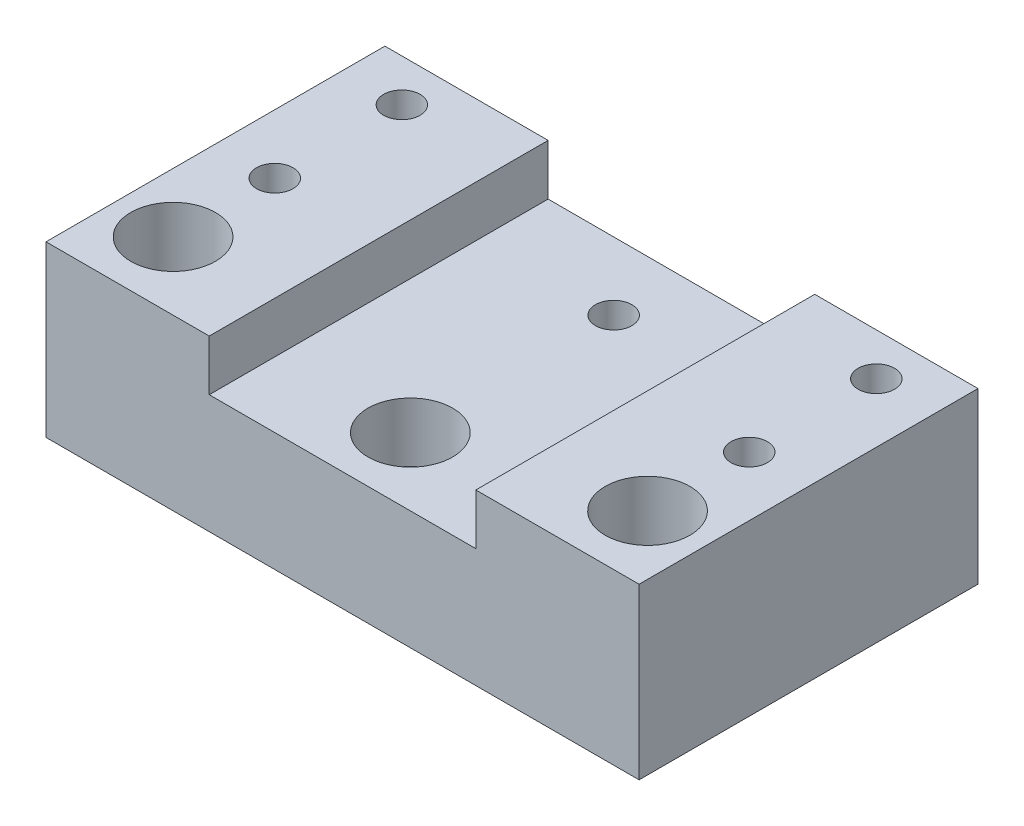
ISO-10303-21;
HEADER;
FILE_DESCRIPTION(('STEP AP214'),'2;1');
FILE_NAME('part.step','',(''),(''),'','','');
FILE_SCHEMA(('AUTOMOTIVE_DESIGN { 1 0 10303 214 1 1 1 1 }'));
ENDSEC;
DATA;
#1=APPLICATION_CONTEXT('core data for automotive mechanical design processes');
#2=APPLICATION_PROTOCOL_DEFINITION('international standard','automotive_design',2000,#1);
#3=PRODUCT_CONTEXT('',#1,'mechanical');
#4=PRODUCT('Part','Part','',(#3));
#5=PRODUCT_RELATED_PRODUCT_CATEGORY('part','',(#4));
#6=PRODUCT_DEFINITION_FORMATION('','',#4);
#7=PRODUCT_DEFINITION_CONTEXT('part definition',#1,'design');
#8=PRODUCT_DEFINITION('design','',#6,#7);
#9=PRODUCT_DEFINITION_SHAPE('','',#8);
#10=(LENGTH_UNIT() NAMED_UNIT(*) SI_UNIT(.MILLI.,.METRE.));
#11=(NAMED_UNIT(*) PLANE_ANGLE_UNIT() SI_UNIT($,.RADIAN.));
#12=(NAMED_UNIT(*) SI_UNIT($,.STERADIAN.) SOLID_ANGLE_UNIT());
#13=UNCERTAINTY_MEASURE_WITH_UNIT(LENGTH_MEASURE(1.E-05),#10,'distance_accuracy_value','');
#14=(GEOMETRIC_REPRESENTATION_CONTEXT(3) GLOBAL_UNCERTAINTY_ASSIGNED_CONTEXT((#13)) GLOBAL_UNIT_ASSIGNED_CONTEXT((#10,
#11,#12)) REPRESENTATION_CONTEXT('',''));
#15=CARTESIAN_POINT('',(0.,0.,0.));
#16=DIRECTION('',(0.,0.,1.));
#17=DIRECTION('',(1.,0.,0.));
#18=AXIS2_PLACEMENT_3D('',#15,#16,#17);
#19=CARTESIAN_POINT('',(-50.0721058637928,28.3687471029999,32.));
#20=DIRECTION('',(0.,1.,0.));
#21=DIRECTION('',(0.,0.,1.));
#22=AXIS2_PLACEMENT_3D('',#19,#20,#21);
#23=CYLINDRICAL_SURFACE('',#22,4.2);
#24=CARTESIAN_POINT('',(-50.0721058637928,14.3687471029999,32.));
#25=DIRECTION('',(0.,1.,0.));
#26=DIRECTION('',(0.,0.,1.));
#27=AXIS2_PLACEMENT_3D('',#24,#25,#26);
#28=CIRCLE('',#27,4.2);
#29=CARTESIAN_POINT('',(-50.0721058637928,14.3687471029999,36.2));
#30=VERTEX_POINT('',#29);
#31=EDGE_CURVE('E201',#30,#30,#28,.T.);
#32=ORIENTED_EDGE('',*,*,#31,.F.);
#33=EDGE_LOOP('',(#32));
#34=FACE_BOUND('',#33,.T.);
#35=CARTESIAN_POINT('',(-50.0721058637928,21.3687471029999,32.));
#36=DIRECTION('',(0.,1.,0.));
#37=DIRECTION('',(-1.,0.,0.));
#38=AXIS2_PLACEMENT_3D('',#35,#36,#37);
#39=CIRCLE('',#38,4.2);
#40=CARTESIAN_POINT('',(-54.2721058637928,21.3687471029999,32.));
#41=VERTEX_POINT('',#40);
#42=EDGE_CURVE('E50',#41,#41,#39,.F.);
#43=ORIENTED_EDGE('',*,*,#42,.F.);
#44=EDGE_LOOP('',(#43));
#45=FACE_BOUND('',#44,.T.);
#46=ADVANCED_FACE('F46',(#34,#45),#23,.F.);
#47=CARTESIAN_POINT('',(-22.0721058637928,34.3687471029999,32.));
#48=DIRECTION('',(0.,1.,0.));
#49=DIRECTION('',(0.,0.,1.));
#50=AXIS2_PLACEMENT_3D('',#47,#48,#49);
#51=CYLINDRICAL_SURFACE('',#50,2.65);
#52=CARTESIAN_POINT('',(-22.0721058637928,14.3687471029999,32.));
#53=DIRECTION('',(0.,1.,0.));
#54=DIRECTION('',(0.,0.,1.));
#55=AXIS2_PLACEMENT_3D('',#52,#53,#54);
#56=CIRCLE('',#55,2.65);
#57=CARTESIAN_POINT('',(-22.0721058637928,14.3687471029999,34.65));
#58=VERTEX_POINT('',#57);
#59=EDGE_CURVE('E212',#58,#58,#56,.T.);
#60=ORIENTED_EDGE('',*,*,#59,.F.);
#61=EDGE_LOOP('',(#60));
#62=FACE_BOUND('',#61,.T.);
#63=CARTESIAN_POINT('',(-22.0721058637928,22.3687471029999,32.));
#64=DIRECTION('',(0.,1.,0.));
#65=DIRECTION('',(0.,0.,1.));
#66=AXIS2_PLACEMENT_3D('',#63,#64,#65);
#67=CIRCLE('',#66,2.65);
#68=CARTESIAN_POINT('',(-22.0721058637928,22.3687471029999,34.65));
#69=VERTEX_POINT('',#68);
#70=EDGE_CURVE('E197',#69,#69,#67,.F.);
#71=ORIENTED_EDGE('',*,*,#70,.F.);
#72=EDGE_LOOP('',(#71));
#73=FACE_BOUND('',#72,.T.);
#74=ADVANCED_FACE('F290',(#62,#73),#51,.F.);
#75=CARTESIAN_POINT('',(-78.0721058637928,34.3687471029999,32.));
#76=DIRECTION('',(0.,1.,0.));
#77=DIRECTION('',(0.,0.,1.));
#78=AXIS2_PLACEMENT_3D('',#75,#76,#77);
#79=CYLINDRICAL_SURFACE('',#78,2.65);
#80=CARTESIAN_POINT('',(-78.0721058637928,14.3687471029999,32.));
#81=DIRECTION('',(0.,1.,0.));
#82=DIRECTION('',(0.,0.,1.));
#83=AXIS2_PLACEMENT_3D('',#80,#81,#82);
#84=CIRCLE('',#83,2.65);
#85=CARTESIAN_POINT('',(-78.0721058637928,14.3687471029999,34.65));
#86=VERTEX_POINT('',#85);
#87=EDGE_CURVE('E206',#86,#86,#84,.T.);
#88=ORIENTED_EDGE('',*,*,#87,.F.);
#89=EDGE_LOOP('',(#88));
#90=FACE_BOUND('',#89,.T.);
#91=CARTESIAN_POINT('',(-78.0721058637928,22.3687471029999,32.));
#92=DIRECTION('',(0.,1.,0.));
#93=DIRECTION('',(0.,0.,1.));
#94=AXIS2_PLACEMENT_3D('',#91,#92,#93);
#95=CIRCLE('',#94,2.65);
#96=CARTESIAN_POINT('',(-78.0721058637928,22.3687471029999,34.65));
#97=VERTEX_POINT('',#96);
#98=EDGE_CURVE('E194',#97,#97,#95,.F.);
#99=ORIENTED_EDGE('',*,*,#98,.F.);
#100=EDGE_LOOP('',(#99));
#101=FACE_BOUND('',#100,.T.);
#102=ADVANCED_FACE('F298',(#90,#101),#79,.F.);
#103=CARTESIAN_POINT('',(0.,34.3687471029999,40.));
#104=DIRECTION('',(0.,-1.,0.));
#105=DIRECTION('',(0.,0.,-1.));
#106=AXIS2_PLACEMENT_3D('',#103,#104,#105);
#107=PLANE('',#106);
#108=CARTESIAN_POINT('',(-22.0721058637928,34.3687471029999,32.));
#109=DIRECTION('',(0.,1.,0.));
#110=DIRECTION('',(0.,0.,1.));
#111=AXIS2_PLACEMENT_3D('',#108,#109,#110);
#112=CIRCLE('',#111,5.);
#113=CARTESIAN_POINT('',(-22.0721058637928,34.3687471029999,37.));
#114=VERTEX_POINT('',#113);
#115=EDGE_CURVE('E467',#114,#114,#112,.T.);
#116=ORIENTED_EDGE('',*,*,#115,.F.);
#117=EDGE_LOOP('',(#116));
#118=FACE_BOUND('',#117,.T.);
#119=CARTESIAN_POINT('',(-22.0721058637928,34.3687471029999,20.));
#120=DIRECTION('',(0.,1.,0.));
#121=DIRECTION('',(0.,0.,1.));
#122=AXIS2_PLACEMENT_3D('',#119,#120,#121);
#123=CIRCLE('',#122,2.15);
#124=CARTESIAN_POINT('',(-22.0721058637928,34.3687471029999,22.15));
#125=VERTEX_POINT('',#124);
#126=EDGE_CURVE('E237',#125,#125,#123,.T.);
#127=ORIENTED_EDGE('',*,*,#126,.F.);
#128=EDGE_LOOP('',(#127));
#129=FACE_BOUND('',#128,.T.);
#130=DIRECTION('',(-1.,0.,0.));
#131=VECTOR('',#130,1.);
#132=CARTESIAN_POINT('',(0.,34.3687471029999,0.));
#133=LINE('',#132,#131);
#134=CARTESIAN_POINT('',(-15.0721058637928,34.3687471029999,0.));
#135=VERTEX_POINT('',#134);
#136=CARTESIAN_POINT('',(-34.3387725304595,34.3687471029999,0.));
#137=VERTEX_POINT('',#136);
#138=EDGE_CURVE('E157',#135,#137,#133,.T.);
#139=ORIENTED_EDGE('',*,*,#138,.T.);
#140=DIRECTION('',(0.,0.,-1.));
#141=VECTOR('',#140,1.);
#142=CARTESIAN_POINT('',(-34.3387725304595,34.3687471029999,40.));
#143=LINE('',#142,#141);
#144=CARTESIAN_POINT('',(-34.3387725304595,34.3687471029999,40.));
#145=VERTEX_POINT('',#144);
#146=EDGE_CURVE('E187',#145,#137,#143,.T.);
#147=ORIENTED_EDGE('',*,*,#146,.F.);
#148=DIRECTION('',(-1.,0.,0.));
#149=VECTOR('',#148,1.);
#150=CARTESIAN_POINT('',(0.,34.3687471029999,40.));
#151=LINE('',#150,#149);
#152=CARTESIAN_POINT('',(-15.0721058637928,34.3687471029999,40.));
#153=VERTEX_POINT('',#152);
#154=EDGE_CURVE('E264',#153,#145,#151,.T.);
#155=ORIENTED_EDGE('',*,*,#154,.F.);
#156=DIRECTION('',(0.,0.,-1.));
#157=VECTOR('',#156,1.);
#158=CARTESIAN_POINT('',(-15.0721058637928,34.3687471029999,40.));
#159=LINE('',#158,#157);
#160=EDGE_CURVE('E57',#153,#135,#159,.T.);
#161=ORIENTED_EDGE('',*,*,#160,.T.);
#162=EDGE_LOOP('',(#139,#147,#155,#161));
#163=FACE_BOUND('',#162,.T.);
#164=CARTESIAN_POINT('',(-22.0721058637928,34.3687471029999,5.));
#165=DIRECTION('',(0.,1.,0.));
#166=DIRECTION('',(0.,0.,1.));
#167=AXIS2_PLACEMENT_3D('',#164,#165,#166);
#168=CIRCLE('',#167,2.15);
#169=CARTESIAN_POINT('',(-22.0721058637928,34.3687471029999,7.15));
#170=VERTEX_POINT('',#169);
#171=EDGE_CURVE('E245',#170,#170,#168,.T.);
#172=ORIENTED_EDGE('',*,*,#171,.F.);
#173=EDGE_LOOP('',(#172));
#174=FACE_BOUND('',#173,.T.);
#175=ADVANCED_FACE('F307',(#118,#129,#163,#174),#107,.F.);
#176=CARTESIAN_POINT('',(0.,14.3687471029999,40.));
#177=DIRECTION('',(0.,1.,0.));
#178=DIRECTION('',(-1.,0.,0.));
#179=AXIS2_PLACEMENT_3D('',#176,#177,#178);
#180=PLANE('',#179);
#181=ORIENTED_EDGE('',*,*,#31,.T.);
#182=EDGE_LOOP('',(#181));
#183=FACE_BOUND('',#182,.T.);
#184=ORIENTED_EDGE('',*,*,#87,.T.);
#185=EDGE_LOOP('',(#184));
#186=FACE_BOUND('',#185,.T.);
#187=ORIENTED_EDGE('',*,*,#59,.T.);
#188=EDGE_LOOP('',(#187));
#189=FACE_BOUND('',#188,.T.);
#190=CARTESIAN_POINT('',(-78.0721058637928,14.3687471029999,5.));
#191=DIRECTION('',(0.,1.,0.));
#192=DIRECTION('',(0.,0.,1.));
#193=AXIS2_PLACEMENT_3D('',#190,#191,#192);
#194=CIRCLE('',#193,2.15);
#195=CARTESIAN_POINT('',(-78.0721058637928,14.3687471029999,7.15));
#196=VERTEX_POINT('',#195);
#197=EDGE_CURVE('E225',#196,#196,#194,.T.);
#198=ORIENTED_EDGE('',*,*,#197,.T.);
#199=EDGE_LOOP('',(#198));
#200=FACE_BOUND('',#199,.T.);
#201=CARTESIAN_POINT('',(-78.0721058637928,14.3687471029999,20.));
#202=DIRECTION('',(0.,1.,0.));
#203=DIRECTION('',(0.,0.,1.));
#204=AXIS2_PLACEMENT_3D('',#201,#202,#203);
#205=CIRCLE('',#204,2.15);
#206=CARTESIAN_POINT('',(-78.0721058637928,14.3687471029999,22.15));
#207=VERTEX_POINT('',#206);
#208=EDGE_CURVE('E233',#207,#207,#205,.T.);
#209=ORIENTED_EDGE('',*,*,#208,.T.);
#210=EDGE_LOOP('',(#209));
#211=FACE_BOUND('',#210,.T.);
#212=CARTESIAN_POINT('',(-22.0721058637928,14.3687471029999,20.));
#213=DIRECTION('',(0.,1.,0.));
#214=DIRECTION('',(0.,0.,1.));
#215=AXIS2_PLACEMENT_3D('',#212,#213,#214);
#216=CIRCLE('',#215,2.15);
#217=CARTESIAN_POINT('',(-22.0721058637928,14.3687471029999,22.15));
#218=VERTEX_POINT('',#217);
#219=EDGE_CURVE('E241',#218,#218,#216,.T.);
#220=ORIENTED_EDGE('',*,*,#219,.T.);
#221=EDGE_LOOP('',(#220));
#222=FACE_BOUND('',#221,.T.);
#223=CARTESIAN_POINT('',(-22.0721058637928,14.3687471029999,5.));
#224=DIRECTION('',(0.,1.,0.));
#225=DIRECTION('',(0.,0.,1.));
#226=AXIS2_PLACEMENT_3D('',#223,#224,#225);
#227=CIRCLE('',#226,2.15);
#228=CARTESIAN_POINT('',(-22.0721058637928,14.3687471029999,7.14999999999999));
#229=VERTEX_POINT('',#228);
#230=EDGE_CURVE('E249',#229,#229,#227,.T.);
#231=ORIENTED_EDGE('',*,*,#230,.T.);
#232=EDGE_LOOP('',(#231));
#233=FACE_BOUND('',#232,.T.);
#234=CARTESIAN_POINT('',(-50.0721058637928,14.3687471029999,8.));
#235=DIRECTION('',(0.,1.,0.));
#236=DIRECTION('',(0.,0.,1.));
#237=AXIS2_PLACEMENT_3D('',#234,#235,#236);
#238=CIRCLE('',#237,2.15);
#239=CARTESIAN_POINT('',(-50.0721058637928,14.3687471029999,10.15));
#240=VERTEX_POINT('',#239);
#241=EDGE_CURVE('E154',#240,#240,#238,.T.);
#242=ORIENTED_EDGE('',*,*,#241,.T.);
#243=EDGE_LOOP('',(#242));
#244=FACE_BOUND('',#243,.T.);
#245=DIRECTION('',(1.,0.,0.));
#246=VECTOR('',#245,1.);
#247=CARTESIAN_POINT('',(0.,14.3687471029999,0.));
#248=LINE('',#247,#246);
#249=CARTESIAN_POINT('',(-85.0721058637928,14.3687471029999,0.));
#250=VERTEX_POINT('',#249);
#251=CARTESIAN_POINT('',(-15.0721058637928,14.3687471029999,0.));
#252=VERTEX_POINT('',#251);
#253=EDGE_CURVE('E150',#250,#252,#248,.T.);
#254=ORIENTED_EDGE('',*,*,#253,.T.);
#255=DIRECTION('',(0.,0.,-1.));
#256=VECTOR('',#255,1.);
#257=CARTESIAN_POINT('',(-15.0721058637928,14.3687471029999,40.));
#258=LINE('',#257,#256);
#259=CARTESIAN_POINT('',(-15.0721058637928,14.3687471029999,40.));
#260=VERTEX_POINT('',#259);
#261=EDGE_CURVE('E11',#260,#252,#258,.T.);
#262=ORIENTED_EDGE('',*,*,#261,.F.);
#263=DIRECTION('',(1.,0.,0.));
#264=VECTOR('',#263,1.);
#265=CARTESIAN_POINT('',(0.,14.3687471029999,40.));
#266=LINE('',#265,#264);
#267=CARTESIAN_POINT('',(-85.0721058637928,14.3687471029999,40.));
#268=VERTEX_POINT('',#267);
#269=EDGE_CURVE('E177',#268,#260,#266,.T.);
#270=ORIENTED_EDGE('',*,*,#269,.F.);
#271=DIRECTION('',(0.,0.,-1.));
#272=VECTOR('',#271,1.);
#273=CARTESIAN_POINT('',(-85.0721058637928,14.3687471029999,40.));
#274=LINE('',#273,#272);
#275=EDGE_CURVE('E66',#268,#250,#274,.T.);
#276=ORIENTED_EDGE('',*,*,#275,.T.);
#277=EDGE_LOOP('',(#254,#262,#270,#276));
#278=FACE_BOUND('',#277,.T.);
#279=ADVANCED_FACE('F48',(#183,#186,#189,#200,#211,#222,#233,#244,#278),#180,.F.);
#280=CARTESIAN_POINT('',(-15.0721058637928,0.,40.));
#281=DIRECTION('',(-1.,0.,0.));
#282=DIRECTION('',(0.,0.,1.));
#283=AXIS2_PLACEMENT_3D('',#280,#281,#282);
#284=PLANE('',#283);
#285=DIRECTION('',(0.,1.,0.));
#286=VECTOR('',#285,1.);
#287=CARTESIAN_POINT('',(-15.0721058637928,0.,0.));
#288=LINE('',#287,#286);
#289=EDGE_CURVE('E153',#252,#135,#288,.T.);
#290=ORIENTED_EDGE('',*,*,#289,.T.);
#291=ORIENTED_EDGE('',*,*,#160,.F.);
#292=DIRECTION('',(0.,1.,0.));
#293=VECTOR('',#292,1.);
#294=CARTESIAN_POINT('',(-15.0721058637928,0.,40.));
#295=LINE('',#294,#293);
#296=EDGE_CURVE('E104',#260,#153,#295,.T.);
#297=ORIENTED_EDGE('',*,*,#296,.F.);
#298=ORIENTED_EDGE('',*,*,#261,.T.);
#299=EDGE_LOOP('',(#290,#291,#297,#298));
#300=FACE_BOUND('',#299,.T.);
#301=ADVANCED_FACE('F368',(#300),#284,.F.);
#302=CARTESIAN_POINT('',(-34.3387725304595,0.,40.));
#303=DIRECTION('',(1.,0.,0.));
#304=DIRECTION('',(0.,0.,-1.));
#305=AXIS2_PLACEMENT_3D('',#302,#303,#304);
#306=PLANE('',#305);
#307=DIRECTION('',(0.,-1.,0.));
#308=VECTOR('',#307,1.);
#309=CARTESIAN_POINT('',(-34.3387725304595,0.,0.));
#310=LINE('',#309,#308);
#311=CARTESIAN_POINT('',(-34.3387725304595,28.3687471029999,0.));
#312=VERTEX_POINT('',#311);
#313=EDGE_CURVE('E160',#137,#312,#310,.T.);
#314=ORIENTED_EDGE('',*,*,#313,.T.);
#315=DIRECTION('',(0.,0.,-1.));
#316=VECTOR('',#315,1.);
#317=CARTESIAN_POINT('',(-34.3387725304595,28.3687471029999,40.));
#318=LINE('',#317,#316);
#319=CARTESIAN_POINT('',(-34.3387725304595,28.3687471029999,40.));
#320=VERTEX_POINT('',#319);
#321=EDGE_CURVE('E184',#320,#312,#318,.T.);
#322=ORIENTED_EDGE('',*,*,#321,.F.);
#323=DIRECTION('',(0.,-1.,0.));
#324=VECTOR('',#323,1.);
#325=CARTESIAN_POINT('',(-34.3387725304595,0.,40.));
#326=LINE('',#325,#324);
#327=EDGE_CURVE('E267',#145,#320,#326,.T.);
#328=ORIENTED_EDGE('',*,*,#327,.F.);
#329=ORIENTED_EDGE('',*,*,#146,.T.);
#330=EDGE_LOOP('',(#314,#322,#328,#329));
#331=FACE_BOUND('',#330,.T.);
#332=ADVANCED_FACE('F490',(#331),#306,.F.);
#333=CARTESIAN_POINT('',(0.,28.3687471029999,40.));
#334=DIRECTION('',(0.,1.,0.));
#335=DIRECTION('',(-1.,0.,0.));
#336=AXIS2_PLACEMENT_3D('',#333,#334,#335);
#337=PLANE('',#336);
#338=CARTESIAN_POINT('',(-50.0721058637928,28.3687471029999,32.));
#339=DIRECTION('',(0.,1.,0.));
#340=DIRECTION('',(-1.,0.,0.));
#341=AXIS2_PLACEMENT_3D('',#338,#339,#340);
#342=CIRCLE('',#341,5.);
#343=CARTESIAN_POINT('',(-55.0721058637928,28.3687471029999,32.));
#344=VERTEX_POINT('',#343);
#345=EDGE_CURVE('E454',#344,#344,#342,.T.);
#346=ORIENTED_EDGE('',*,*,#345,.F.);
#347=EDGE_LOOP('',(#346));
#348=FACE_BOUND('',#347,.T.);
#349=CARTESIAN_POINT('',(-50.0721058637928,28.3687471029999,8.));
#350=DIRECTION('',(0.,1.,0.));
#351=DIRECTION('',(0.,0.,1.));
#352=AXIS2_PLACEMENT_3D('',#349,#350,#351);
#353=CIRCLE('',#352,2.15);
#354=CARTESIAN_POINT('',(-50.0721058637928,28.3687471029999,10.15));
#355=VERTEX_POINT('',#354);
#356=EDGE_CURVE('E253',#355,#355,#353,.T.);
#357=ORIENTED_EDGE('',*,*,#356,.F.);
#358=EDGE_LOOP('',(#357));
#359=FACE_BOUND('',#358,.T.);
#360=DIRECTION('',(1.,0.,0.));
#361=VECTOR('',#360,1.);
#362=CARTESIAN_POINT('',(0.,28.3687471029999,0.));
#363=LINE('',#362,#361);
#364=CARTESIAN_POINT('',(-65.8054391971261,28.3687471029999,0.));
#365=VERTEX_POINT('',#364);
#366=EDGE_CURVE('E164',#365,#312,#363,.T.);
#367=ORIENTED_EDGE('',*,*,#366,.F.);
#368=DIRECTION('',(0.,0.,-1.));
#369=VECTOR('',#368,1.);
#370=CARTESIAN_POINT('',(-65.8054391971261,28.3687471029999,40.));
#371=LINE('',#370,#369);
#372=CARTESIAN_POINT('',(-65.8054391971261,28.3687471029999,40.));
#373=VERTEX_POINT('',#372);
#374=EDGE_CURVE('E130',#373,#365,#371,.T.);
#375=ORIENTED_EDGE('',*,*,#374,.F.);
#376=DIRECTION('',(1.,0.,0.));
#377=VECTOR('',#376,1.);
#378=CARTESIAN_POINT('',(0.,28.3687471029999,40.));
#379=LINE('',#378,#377);
#380=EDGE_CURVE('E139',#373,#320,#379,.T.);
#381=ORIENTED_EDGE('',*,*,#380,.T.);
#382=ORIENTED_EDGE('',*,*,#321,.T.);
#383=EDGE_LOOP('',(#367,#375,#381,#382));
#384=FACE_BOUND('',#383,.T.);
#385=ADVANCED_FACE('F272',(#348,#359,#384),#337,.T.);
#386=CARTESIAN_POINT('',(-65.8054391971261,0.,40.));
#387=DIRECTION('',(1.,0.,0.));
#388=DIRECTION('',(0.,0.,-1.));
#389=AXIS2_PLACEMENT_3D('',#386,#387,#388);
#390=PLANE('',#389);
#391=DIRECTION('',(0.,-1.,0.));
#392=VECTOR('',#391,1.);
#393=CARTESIAN_POINT('',(-65.8054391971261,0.,0.));
#394=LINE('',#393,#392);
#395=CARTESIAN_POINT('',(-65.8054391971261,34.3687471029999,0.));
#396=VERTEX_POINT('',#395);
#397=EDGE_CURVE('E125',#396,#365,#394,.T.);
#398=ORIENTED_EDGE('',*,*,#397,.F.);
#399=DIRECTION('',(0.,0.,-1.));
#400=VECTOR('',#399,1.);
#401=CARTESIAN_POINT('',(-65.8054391971261,34.3687471029999,40.));
#402=LINE('',#401,#400);
#403=CARTESIAN_POINT('',(-65.8054391971261,34.3687471029999,40.));
#404=VERTEX_POINT('',#403);
#405=EDGE_CURVE('E120',#404,#396,#402,.T.);
#406=ORIENTED_EDGE('',*,*,#405,.F.);
#407=DIRECTION('',(0.,-1.,0.));
#408=VECTOR('',#407,1.);
#409=CARTESIAN_POINT('',(-65.8054391971261,0.,40.));
#410=LINE('',#409,#408);
#411=EDGE_CURVE('E123',#404,#373,#410,.T.);
#412=ORIENTED_EDGE('',*,*,#411,.T.);
#413=ORIENTED_EDGE('',*,*,#374,.T.);
#414=EDGE_LOOP('',(#398,#406,#412,#413));
#415=FACE_BOUND('',#414,.T.);
#416=ADVANCED_FACE('F122',(#415),#390,.T.);
#417=CARTESIAN_POINT('',(0.,34.3687471029999,40.));
#418=DIRECTION('',(0.,1.,0.));
#419=DIRECTION('',(0.,0.,1.));
#420=AXIS2_PLACEMENT_3D('',#417,#418,#419);
#421=PLANE('',#420);
#422=CARTESIAN_POINT('',(-78.0721058637928,34.3687471029999,32.));
#423=DIRECTION('',(0.,1.,0.));
#424=DIRECTION('',(0.,0.,1.));
#425=AXIS2_PLACEMENT_3D('',#422,#423,#424);
#426=CIRCLE('',#425,5.);
#427=CARTESIAN_POINT('',(-78.0721058637928,34.3687471029999,37.));
#428=VERTEX_POINT('',#427);
#429=EDGE_CURVE('E464',#428,#428,#426,.T.);
#430=ORIENTED_EDGE('',*,*,#429,.F.);
#431=EDGE_LOOP('',(#430));
#432=FACE_BOUND('',#431,.T.);
#433=CARTESIAN_POINT('',(-78.0721058637928,34.3687471029999,5.));
#434=DIRECTION('',(0.,1.,0.));
#435=DIRECTION('',(0.,0.,1.));
#436=AXIS2_PLACEMENT_3D('',#433,#434,#435);
#437=CIRCLE('',#436,2.15);
#438=CARTESIAN_POINT('',(-78.0721058637928,34.3687471029999,7.15));
#439=VERTEX_POINT('',#438);
#440=EDGE_CURVE('E221',#439,#439,#437,.T.);
#441=ORIENTED_EDGE('',*,*,#440,.F.);
#442=EDGE_LOOP('',(#441));
#443=FACE_BOUND('',#442,.T.);
#444=CARTESIAN_POINT('',(-78.0721058637928,34.3687471029999,20.));
#445=DIRECTION('',(0.,1.,0.));
#446=DIRECTION('',(0.,0.,1.));
#447=AXIS2_PLACEMENT_3D('',#444,#445,#446);
#448=CIRCLE('',#447,2.15);
#449=CARTESIAN_POINT('',(-78.0721058637928,34.3687471029999,22.15));
#450=VERTEX_POINT('',#449);
#451=EDGE_CURVE('E229',#450,#450,#448,.T.);
#452=ORIENTED_EDGE('',*,*,#451,.F.);
#453=EDGE_LOOP('',(#452));
#454=FACE_BOUND('',#453,.T.);
#455=DIRECTION('',(1.,0.,0.));
#456=VECTOR('',#455,1.);
#457=CARTESIAN_POINT('',(0.,34.3687471029999,0.));
#458=LINE('',#457,#456);
#459=CARTESIAN_POINT('',(-85.0721058637928,34.3687471029999,0.));
#460=VERTEX_POINT('',#459);
#461=EDGE_CURVE('E170',#460,#396,#458,.T.);
#462=ORIENTED_EDGE('',*,*,#461,.F.);
#463=DIRECTION('',(0.,0.,-1.));
#464=VECTOR('',#463,1.);
#465=CARTESIAN_POINT('',(-85.0721058637928,34.3687471029999,40.));
#466=LINE('',#465,#464);
#467=CARTESIAN_POINT('',(-85.0721058637928,34.3687471029999,40.));
#468=VERTEX_POINT('',#467);
#469=EDGE_CURVE('E92',#468,#460,#466,.T.);
#470=ORIENTED_EDGE('',*,*,#469,.F.);
#471=DIRECTION('',(1.,0.,0.));
#472=VECTOR('',#471,1.);
#473=CARTESIAN_POINT('',(0.,34.3687471029999,40.));
#474=LINE('',#473,#472);
#475=EDGE_CURVE('E137',#468,#404,#474,.T.);
#476=ORIENTED_EDGE('',*,*,#475,.T.);
#477=ORIENTED_EDGE('',*,*,#405,.T.);
#478=EDGE_LOOP('',(#462,#470,#476,#477));
#479=FACE_BOUND('',#478,.T.);
#480=ADVANCED_FACE('F142',(#432,#443,#454,#479),#421,.T.);
#481=CARTESIAN_POINT('',(-85.0721058637928,0.,40.));
#482=DIRECTION('',(-1.,0.,0.));
#483=DIRECTION('',(0.,0.,1.));
#484=AXIS2_PLACEMENT_3D('',#481,#482,#483);
#485=PLANE('',#484);
#486=DIRECTION('',(0.,1.,0.));
#487=VECTOR('',#486,1.);
#488=CARTESIAN_POINT('',(-85.0721058637928,0.,0.));
#489=LINE('',#488,#487);
#490=EDGE_CURVE('E173',#250,#460,#489,.T.);
#491=ORIENTED_EDGE('',*,*,#490,.F.);
#492=ORIENTED_EDGE('',*,*,#275,.F.);
#493=DIRECTION('',(0.,1.,0.));
#494=VECTOR('',#493,1.);
#495=CARTESIAN_POINT('',(-85.0721058637928,0.,40.));
#496=LINE('',#495,#494);
#497=EDGE_CURVE('E144',#268,#468,#496,.T.);
#498=ORIENTED_EDGE('',*,*,#497,.T.);
#499=ORIENTED_EDGE('',*,*,#469,.T.);
#500=EDGE_LOOP('',(#491,#492,#498,#499));
#501=FACE_BOUND('',#500,.T.);
#502=ADVANCED_FACE('F277',(#501),#485,.T.);
#503=CARTESIAN_POINT('',(0.,0.,40.));
#504=DIRECTION('',(0.,0.,1.));
#505=DIRECTION('',(1.,0.,0.));
#506=AXIS2_PLACEMENT_3D('',#503,#504,#505);
#507=PLANE('',#506);
#508=ORIENTED_EDGE('',*,*,#269,.T.);
#509=ORIENTED_EDGE('',*,*,#296,.T.);
#510=ORIENTED_EDGE('',*,*,#154,.T.);
#511=ORIENTED_EDGE('',*,*,#327,.T.);
#512=ORIENTED_EDGE('',*,*,#380,.F.);
#513=ORIENTED_EDGE('',*,*,#411,.F.);
#514=ORIENTED_EDGE('',*,*,#475,.F.);
#515=ORIENTED_EDGE('',*,*,#497,.F.);
#516=EDGE_LOOP('',(#508,#509,#510,#511,#512,#513,#514,#515));
#517=FACE_BOUND('',#516,.T.);
#518=ADVANCED_FACE('F135',(#517),#507,.T.);
#519=CARTESIAN_POINT('',(0.,0.,0.));
#520=DIRECTION('',(0.,0.,1.));
#521=DIRECTION('',(1.,0.,0.));
#522=AXIS2_PLACEMENT_3D('',#519,#520,#521);
#523=PLANE('',#522);
#524=ORIENTED_EDGE('',*,*,#253,.F.);
#525=ORIENTED_EDGE('',*,*,#490,.T.);
#526=ORIENTED_EDGE('',*,*,#461,.T.);
#527=ORIENTED_EDGE('',*,*,#397,.T.);
#528=ORIENTED_EDGE('',*,*,#366,.T.);
#529=ORIENTED_EDGE('',*,*,#313,.F.);
#530=ORIENTED_EDGE('',*,*,#138,.F.);
#531=ORIENTED_EDGE('',*,*,#289,.F.);
#532=EDGE_LOOP('',(#524,#525,#526,#527,#528,#529,#530,#531));
#533=FACE_BOUND('',#532,.T.);
#534=ADVANCED_FACE('F276',(#533),#523,.F.);
#535=CARTESIAN_POINT('',(-50.0721058637928,28.3687471029999,8.));
#536=DIRECTION('',(0.,1.,0.));
#537=DIRECTION('',(0.,0.,1.));
#538=AXIS2_PLACEMENT_3D('',#535,#536,#537);
#539=CYLINDRICAL_SURFACE('',#538,2.15);
#540=ORIENTED_EDGE('',*,*,#241,.F.);
#541=EDGE_LOOP('',(#540));
#542=FACE_BOUND('',#541,.T.);
#543=ORIENTED_EDGE('',*,*,#356,.T.);
#544=EDGE_LOOP('',(#543));
#545=FACE_BOUND('',#544,.T.);
#546=ADVANCED_FACE('F326',(#542,#545),#539,.F.);
#547=CARTESIAN_POINT('',(-22.0721058637928,34.3687471029999,5.));
#548=DIRECTION('',(0.,1.,0.));
#549=DIRECTION('',(0.,0.,1.));
#550=AXIS2_PLACEMENT_3D('',#547,#548,#549);
#551=CYLINDRICAL_SURFACE('',#550,2.15);
#552=ORIENTED_EDGE('',*,*,#230,.F.);
#553=EDGE_LOOP('',(#552));
#554=FACE_BOUND('',#553,.T.);
#555=ORIENTED_EDGE('',*,*,#171,.T.);
#556=EDGE_LOOP('',(#555));
#557=FACE_BOUND('',#556,.T.);
#558=ADVANCED_FACE('F322',(#554,#557),#551,.F.);
#559=CARTESIAN_POINT('',(-22.0721058637928,34.3687471029999,20.));
#560=DIRECTION('',(0.,1.,0.));
#561=DIRECTION('',(0.,0.,1.));
#562=AXIS2_PLACEMENT_3D('',#559,#560,#561);
#563=CYLINDRICAL_SURFACE('',#562,2.15);
#564=ORIENTED_EDGE('',*,*,#219,.F.);
#565=EDGE_LOOP('',(#564));
#566=FACE_BOUND('',#565,.T.);
#567=ORIENTED_EDGE('',*,*,#126,.T.);
#568=EDGE_LOOP('',(#567));
#569=FACE_BOUND('',#568,.T.);
#570=ADVANCED_FACE('F318',(#566,#569),#563,.F.);
#571=CARTESIAN_POINT('',(-78.0721058637928,34.3687471029999,20.));
#572=DIRECTION('',(0.,1.,0.));
#573=DIRECTION('',(0.,0.,1.));
#574=AXIS2_PLACEMENT_3D('',#571,#572,#573);
#575=CYLINDRICAL_SURFACE('',#574,2.15);
#576=ORIENTED_EDGE('',*,*,#208,.F.);
#577=EDGE_LOOP('',(#576));
#578=FACE_BOUND('',#577,.T.);
#579=ORIENTED_EDGE('',*,*,#451,.T.);
#580=EDGE_LOOP('',(#579));
#581=FACE_BOUND('',#580,.T.);
#582=ADVANCED_FACE('F314',(#578,#581),#575,.F.);
#583=CARTESIAN_POINT('',(-78.0721058637928,34.3687471029999,5.));
#584=DIRECTION('',(0.,1.,0.));
#585=DIRECTION('',(0.,0.,1.));
#586=AXIS2_PLACEMENT_3D('',#583,#584,#585);
#587=CYLINDRICAL_SURFACE('',#586,2.15);
#588=ORIENTED_EDGE('',*,*,#197,.F.);
#589=EDGE_LOOP('',(#588));
#590=FACE_BOUND('',#589,.T.);
#591=ORIENTED_EDGE('',*,*,#440,.T.);
#592=EDGE_LOOP('',(#591));
#593=FACE_BOUND('',#592,.T.);
#594=ADVANCED_FACE('F310',(#590,#593),#587,.F.);
#595=CARTESIAN_POINT('',(-78.0721058637928,22.3687471029999,32.));
#596=DIRECTION('',(0.,1.,0.));
#597=DIRECTION('',(0.,0.,1.));
#598=AXIS2_PLACEMENT_3D('',#595,#596,#597);
#599=PLANE('',#598);
#600=CARTESIAN_POINT('',(-78.0721058637928,22.3687471029999,32.));
#601=DIRECTION('',(0.,1.,0.));
#602=DIRECTION('',(0.,0.,1.));
#603=AXIS2_PLACEMENT_3D('',#600,#601,#602);
#604=CIRCLE('',#603,5.);
#605=CARTESIAN_POINT('',(-78.0721058637928,22.3687471029999,37.));
#606=VERTEX_POINT('',#605);
#607=EDGE_CURVE('E198',#606,#606,#604,.T.);
#608=ORIENTED_EDGE('',*,*,#607,.T.);
#609=EDGE_LOOP('',(#608));
#610=FACE_BOUND('',#609,.T.);
#611=ORIENTED_EDGE('',*,*,#98,.T.);
#612=EDGE_LOOP('',(#611));
#613=FACE_BOUND('',#612,.T.);
#614=ADVANCED_FACE('F313',(#610,#613),#599,.T.);
#615=CARTESIAN_POINT('',(-78.0721058637928,22.3687471029999,32.));
#616=DIRECTION('',(0.,1.,0.));
#617=DIRECTION('',(0.,0.,1.));
#618=AXIS2_PLACEMENT_3D('',#615,#616,#617);
#619=CYLINDRICAL_SURFACE('',#618,5.);
#620=ORIENTED_EDGE('',*,*,#607,.F.);
#621=EDGE_LOOP('',(#620));
#622=FACE_BOUND('',#621,.T.);
#623=ORIENTED_EDGE('',*,*,#429,.T.);
#624=EDGE_LOOP('',(#623));
#625=FACE_BOUND('',#624,.T.);
#626=ADVANCED_FACE('F397',(#622,#625),#619,.F.);
#627=CARTESIAN_POINT('',(-22.0721058637928,22.3687471029999,32.));
#628=DIRECTION('',(0.,1.,0.));
#629=DIRECTION('',(0.,0.,1.));
#630=AXIS2_PLACEMENT_3D('',#627,#628,#629);
#631=PLANE('',#630);
#632=CARTESIAN_POINT('',(-22.0721058637928,22.3687471029999,32.));
#633=DIRECTION('',(0.,1.,0.));
#634=DIRECTION('',(0.,0.,1.));
#635=AXIS2_PLACEMENT_3D('',#632,#633,#634);
#636=CIRCLE('',#635,5.);
#637=CARTESIAN_POINT('',(-22.0721058637928,22.3687471029999,37.));
#638=VERTEX_POINT('',#637);
#639=EDGE_CURVE('E215',#638,#638,#636,.T.);
#640=ORIENTED_EDGE('',*,*,#639,.T.);
#641=EDGE_LOOP('',(#640));
#642=FACE_BOUND('',#641,.T.);
#643=ORIENTED_EDGE('',*,*,#70,.T.);
#644=EDGE_LOOP('',(#643));
#645=FACE_BOUND('',#644,.T.);
#646=ADVANCED_FACE('F304',(#642,#645),#631,.T.);
#647=CARTESIAN_POINT('',(-22.0721058637928,22.3687471029999,32.));
#648=DIRECTION('',(0.,1.,0.));
#649=DIRECTION('',(0.,0.,1.));
#650=AXIS2_PLACEMENT_3D('',#647,#648,#649);
#651=CYLINDRICAL_SURFACE('',#650,5.);
#652=ORIENTED_EDGE('',*,*,#639,.F.);
#653=EDGE_LOOP('',(#652));
#654=FACE_BOUND('',#653,.T.);
#655=ORIENTED_EDGE('',*,*,#115,.T.);
#656=EDGE_LOOP('',(#655));
#657=FACE_BOUND('',#656,.T.);
#658=ADVANCED_FACE('F412',(#654,#657),#651,.F.);
#659=CARTESIAN_POINT('',(-50.0721058637928,21.3687471029999,32.));
#660=DIRECTION('',(0.,1.,0.));
#661=DIRECTION('',(-1.,0.,0.));
#662=AXIS2_PLACEMENT_3D('',#659,#660,#661);
#663=PLANE('',#662);
#664=CARTESIAN_POINT('',(-50.0721058637928,21.3687471029999,32.));
#665=DIRECTION('',(0.,1.,0.));
#666=DIRECTION('',(-1.,0.,0.));
#667=AXIS2_PLACEMENT_3D('',#664,#665,#666);
#668=CIRCLE('',#667,5.);
#669=CARTESIAN_POINT('',(-55.0721058637928,21.3687471029999,32.));
#670=VERTEX_POINT('',#669);
#671=EDGE_CURVE('E451',#670,#670,#668,.T.);
#672=ORIENTED_EDGE('',*,*,#671,.T.);
#673=EDGE_LOOP('',(#672));
#674=FACE_BOUND('',#673,.T.);
#675=ORIENTED_EDGE('',*,*,#42,.T.);
#676=EDGE_LOOP('',(#675));
#677=FACE_BOUND('',#676,.T.);
#678=ADVANCED_FACE('F419',(#674,#677),#663,.T.);
#679=CARTESIAN_POINT('',(-50.0721058637928,21.3687471029999,32.));
#680=DIRECTION('',(0.,1.,0.));
#681=DIRECTION('',(-1.,0.,0.));
#682=AXIS2_PLACEMENT_3D('',#679,#680,#681);
#683=CYLINDRICAL_SURFACE('',#682,5.);
#684=ORIENTED_EDGE('',*,*,#671,.F.);
#685=EDGE_LOOP('',(#684));
#686=FACE_BOUND('',#685,.T.);
#687=ORIENTED_EDGE('',*,*,#345,.T.);
#688=EDGE_LOOP('',(#687));
#689=FACE_BOUND('',#688,.T.);
#690=ADVANCED_FACE('F435',(#686,#689),#683,.F.);
#691=CLOSED_SHELL('',(#46,#74,#102,#175,#279,#301,#332,#385,#416,#480,#502,#518,#534,#546,#558,
#570,#582,#594,#614,#626,#646,#658,#678,#690));
#692=MANIFOLD_SOLID_BREP('B2',#691);
#693=ADVANCED_BREP_SHAPE_REPRESENTATION('',(#18,#692),#14);
#694=SHAPE_DEFINITION_REPRESENTATION(#9,#693);
ENDSEC;
END-ISO-10303-21;
